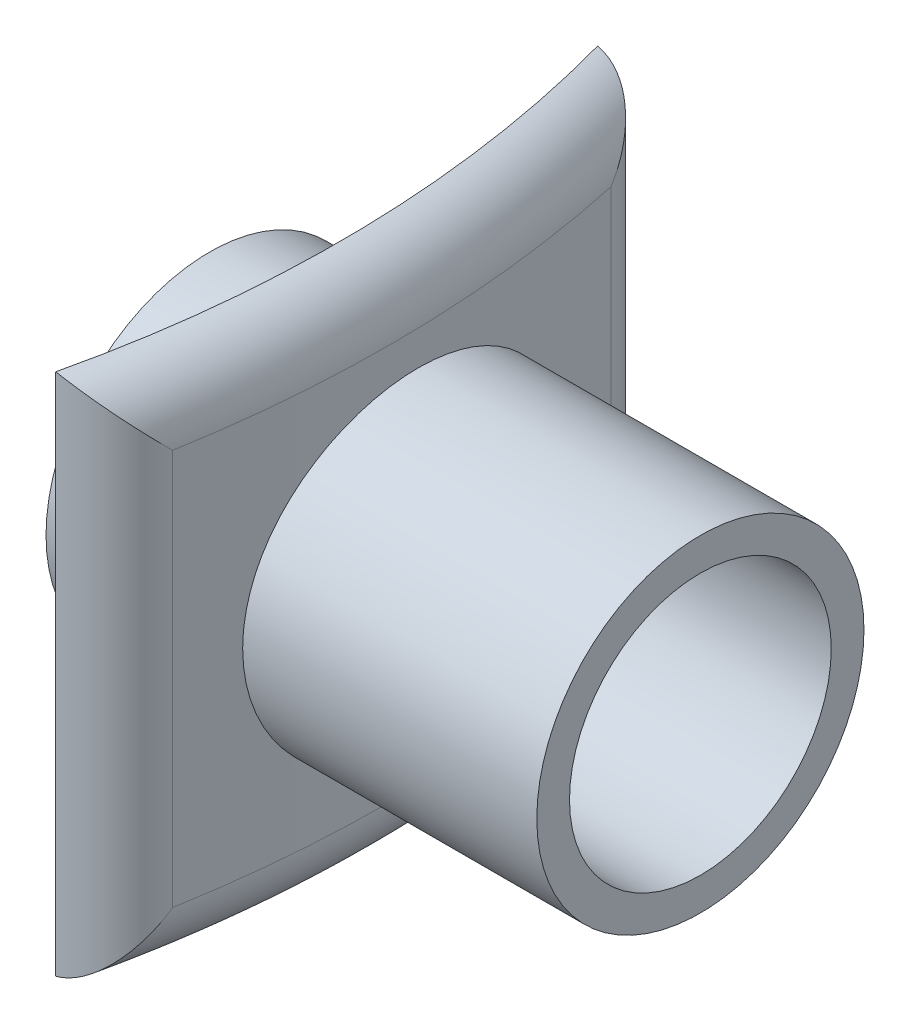
ISO-10303-21;
HEADER;
FILE_DESCRIPTION(('STEP AP214'),'2;1');
FILE_NAME('part.step','',(''),(''),'','','');
FILE_SCHEMA(('AUTOMOTIVE_DESIGN { 1 0 10303 214 1 1 1 1 }'));
ENDSEC;
DATA;
#1=APPLICATION_CONTEXT('core data for automotive mechanical design processes');
#2=APPLICATION_PROTOCOL_DEFINITION('international standard','automotive_design',2000,#1);
#3=PRODUCT_CONTEXT('',#1,'mechanical');
#4=PRODUCT('Part','Part','',(#3));
#5=PRODUCT_RELATED_PRODUCT_CATEGORY('part','',(#4));
#6=PRODUCT_DEFINITION_FORMATION('','',#4);
#7=PRODUCT_DEFINITION_CONTEXT('part definition',#1,'design');
#8=PRODUCT_DEFINITION('design','',#6,#7);
#9=PRODUCT_DEFINITION_SHAPE('','',#8);
#10=(LENGTH_UNIT() NAMED_UNIT(*) SI_UNIT(.MILLI.,.METRE.));
#11=(NAMED_UNIT(*) PLANE_ANGLE_UNIT() SI_UNIT($,.RADIAN.));
#12=(NAMED_UNIT(*) SI_UNIT($,.STERADIAN.) SOLID_ANGLE_UNIT());
#13=UNCERTAINTY_MEASURE_WITH_UNIT(LENGTH_MEASURE(1.E-05),#10,'distance_accuracy_value','');
#14=(GEOMETRIC_REPRESENTATION_CONTEXT(3) GLOBAL_UNCERTAINTY_ASSIGNED_CONTEXT((#13)) GLOBAL_UNIT_ASSIGNED_CONTEXT((#10,
#11,#12)) REPRESENTATION_CONTEXT('',''));
#15=CARTESIAN_POINT('',(0.,0.,0.));
#16=DIRECTION('',(0.,0.,1.));
#17=DIRECTION('',(1.,0.,0.));
#18=AXIS2_PLACEMENT_3D('',#15,#16,#17);
#19=CARTESIAN_POINT('',(15.,0.,0.));
#20=DIRECTION('',(-1.,0.,0.));
#21=DIRECTION('',(0.,0.,1.));
#22=AXIS2_PLACEMENT_3D('',#19,#20,#21);
#23=CYLINDRICAL_SURFACE('',#22,5.);
#24=CARTESIAN_POINT('',(0.,0.,0.));
#25=DIRECTION('',(1.,0.,0.));
#26=DIRECTION('',(0.,0.,-1.));
#27=AXIS2_PLACEMENT_3D('',#24,#25,#26);
#28=CIRCLE('',#27,5.);
#29=CARTESIAN_POINT('',(0.,0.,-5.));
#30=VERTEX_POINT('',#29);
#31=EDGE_CURVE('E183',#30,#30,#28,.T.);
#32=ORIENTED_EDGE('',*,*,#31,.T.);
#33=EDGE_LOOP('',(#32));
#34=FACE_BOUND('',#33,.T.);
#35=CARTESIAN_POINT('',(4.44917981588211,0.,5.));
#36=CARTESIAN_POINT('',(4.44917911633558,-0.139930415510568,5.00000183315159));
#37=CARTESIAN_POINT('',(4.44991744553362,-0.279834688357766,4.99412392857343));
#38=CARTESIAN_POINT('',(4.4528453338377,-0.558686198544076,4.97065819245709));
#39=CARTESIAN_POINT('',(4.45503520201412,-0.697633225692972,4.95306786703639));
#40=CARTESIAN_POINT('',(4.46079788566911,-0.97362663452722,4.9062876135954));
#41=CARTESIAN_POINT('',(4.46437165882238,-1.11067163181438,4.87708965261332));
#42=CARTESIAN_POINT('',(4.47278684955471,-1.38184289617769,4.807298367787));
#43=CARTESIAN_POINT('',(4.47762873096625,-1.51596807579732,4.76670087397435));
#44=CARTESIAN_POINT('',(4.48841615699536,-1.78016154769072,4.67446057603759));
#45=CARTESIAN_POINT('',(4.49436054947994,-1.91023391095801,4.6228292938155));
#46=CARTESIAN_POINT('',(4.50716549187253,-2.16560484992836,4.50884844896092));
#47=CARTESIAN_POINT('',(4.51402637910816,-2.29090164599283,4.44649493743542));
#48=CARTESIAN_POINT('',(4.52843562183407,-2.53573429882887,4.31156337828046));
#49=CARTESIAN_POINT('',(4.53598361109473,-2.65527317325059,4.23899076634416));
#50=CARTESIAN_POINT('',(4.55152717420397,-2.88787793492895,4.08407812647896));
#51=CARTESIAN_POINT('',(4.55952291317301,-3.0009414026879,4.0017344825095));
#52=CARTESIAN_POINT('',(4.57573536181448,-3.22028039164001,3.82746725288139));
#53=CARTESIAN_POINT('',(4.58395293138815,-3.32652162138601,3.73550058330151));
#54=CARTESIAN_POINT('',(4.60030154019633,-3.53093126996503,3.54291544257002));
#55=CARTESIAN_POINT('',(4.6084325462786,-3.62909668634345,3.44229378182047));
#56=CARTESIAN_POINT('',(4.62432678308339,-3.81659215722782,3.23316258062775));
#57=CARTESIAN_POINT('',(4.63209013315163,-3.90592508925385,3.12465562924093));
#58=CARTESIAN_POINT('',(4.64698612735287,-4.07519226578946,2.90043903954912));
#59=CARTESIAN_POINT('',(4.65411853820104,-4.15512303749593,2.78472676385345));
#60=CARTESIAN_POINT('',(4.66750597328013,-4.30510064316727,2.54674726520652));
#61=CARTESIAN_POINT('',(4.67375953028826,-4.37513094970686,2.42446954081811));
#62=CARTESIAN_POINT('',(4.68514372231802,-4.5046669286236,2.17435527050934));
#63=CARTESIAN_POINT('',(4.69027393983362,-4.56416868633564,2.04651667889665));
#64=CARTESIAN_POINT('',(4.69920073538179,-4.67215695098304,1.78627456693971));
#65=CARTESIAN_POINT('',(4.70299786551862,-4.72064801510153,1.6538729613974));
#66=CARTESIAN_POINT('',(4.70909574353309,-4.80630201790285,1.38540706760072));
#67=CARTESIAN_POINT('',(4.71139594305867,-4.84346080272654,1.24934145614209));
#68=CARTESIAN_POINT('',(4.7158148377851,-4.93697463835945,0.839230891125736));
#69=CARTESIAN_POINT('',(4.71553169856963,-4.97628481223209,0.561051827406825));
#70=CARTESIAN_POINT('',(4.70802309570491,-5.00783489635695,0.00228966373802704));
#71=CARTESIAN_POINT('',(4.70079790273673,-5.00007664181493,-0.278293342055803));
#72=CARTESIAN_POINT('',(4.67977240734622,-4.93803402406823,-0.832543729585755));
#73=CARTESIAN_POINT('',(4.66600685447807,-4.88399435460335,-1.10623970332543));
#74=CARTESIAN_POINT('',(4.63294304252601,-4.73136575069864,-1.64054933984618));
#75=CARTESIAN_POINT('',(4.61364455488304,-4.63277497580784,-1.90116246166725));
#76=CARTESIAN_POINT('',(4.57102742088618,-4.39315919750031,-2.40377834716845));
#77=CARTESIAN_POINT('',(4.54768399326359,-4.2518683693458,-2.64565224400981));
#78=CARTESIAN_POINT('',(4.49919557054305,-3.93105919067418,-3.10236450521138));
#79=CARTESIAN_POINT('',(4.47405044902454,-3.75153815588848,-3.31720096949846));
#80=CARTESIAN_POINT('',(4.42409034389036,-3.35720460603166,-3.71599062218461));
#81=CARTESIAN_POINT('',(4.39928116987006,-3.1420573679109,-3.89961376010415));
#82=CARTESIAN_POINT('',(4.35272199807604,-2.68369626674176,-4.2281531280637));
#83=CARTESIAN_POINT('',(4.3309719817655,-2.44048257377705,-4.37306959264985));
#84=CARTESIAN_POINT('',(4.29278873418824,-1.93313526192755,-4.61978686252235));
#85=CARTESIAN_POINT('',(4.27634767764754,-1.6690331540508,-4.721651194664));
#86=CARTESIAN_POINT('',(4.25046885452017,-1.12712673019686,-4.87946800596283));
#87=CARTESIAN_POINT('',(4.24103046715717,-0.849323631121443,-4.93542455482408));
#88=CARTESIAN_POINT('',(4.23023481854564,-0.291583924588795,-4.99927936750501));
#89=CARTESIAN_POINT('',(4.22877902506926,-0.011716232039898,-5.00776362691793));
#90=CARTESIAN_POINT('',(4.23383679160023,0.545438651246245,-4.97798323446594));
#91=CARTESIAN_POINT('',(4.24035004954003,0.8227259393925,-4.93972035455511));
#92=CARTESIAN_POINT('',(4.26059923519645,1.36518438558849,-4.81799715376401));
#93=CARTESIAN_POINT('',(4.27429246553083,1.63041720294997,-4.73480393483821));
#94=CARTESIAN_POINT('',(4.30747490786287,2.14316587301268,-4.52586940839398));
#95=CARTESIAN_POINT('',(4.32696444051267,2.39068074461495,-4.40012574692696));
#96=CARTESIAN_POINT('',(4.36999129851761,2.86343523310111,-4.10835658486742));
#97=CARTESIAN_POINT('',(4.39356368507482,3.08845280638603,-3.94197657603352));
#98=CARTESIAN_POINT('',(4.44231009817555,3.50756289767638,-3.57417781521791));
#99=CARTESIAN_POINT('',(4.46748424025313,3.70165318136102,-3.37275653390043));
#100=CARTESIAN_POINT('',(4.51729942244146,4.0555988399652,-2.93795266100454));
#101=CARTESIAN_POINT('',(4.54193146946011,4.21505121327871,-2.7042407721632));
#102=CARTESIAN_POINT('',(4.58803354045317,4.49243058604295,-2.21305123819728));
#103=CARTESIAN_POINT('',(4.6095036059373,4.61035813064969,-1.95557390513181));
#104=CARTESIAN_POINT('',(4.6473002280526,4.80103143558677,-1.42462528233219));
#105=CARTESIAN_POINT('',(4.66363646723885,4.87386250419699,-1.15118526834765));
#106=CARTESIAN_POINT('',(4.68986929429158,4.97241192052108,-0.595491568337679));
#107=CARTESIAN_POINT('',(4.69976632970861,4.99813354275642,-0.313238496284557));
#108=CARTESIAN_POINT('',(4.70930294692724,5.00078012929847,0.108691850427026));
#109=CARTESIAN_POINT('',(4.71159848983338,4.99578242610426,0.248421531979695));
#110=CARTESIAN_POINT('',(4.71447920283046,4.97411019842571,0.526975838787741));
#111=CARTESIAN_POINT('',(4.71506501860902,4.95744008503948,0.665800785952828));
#112=CARTESIAN_POINT('',(4.71457008111036,4.91252728048902,0.941602154694422));
#113=CARTESIAN_POINT('',(4.71348874551712,4.88428054828077,1.07857791351216));
#114=CARTESIAN_POINT('',(4.70975321944224,4.81643472553042,1.34961548522143));
#115=CARTESIAN_POINT('',(4.70709960494227,4.77683979497782,1.48367834657584));
#116=CARTESIAN_POINT('',(4.70036604324195,4.68672647964083,1.74756190412126));
#117=CARTESIAN_POINT('',(4.69629069882391,4.63624354321477,1.87739482902837));
#118=CARTESIAN_POINT('',(4.68688595208276,4.52466480320587,2.13231317420419));
#119=CARTESIAN_POINT('',(4.68155700647344,4.46357286682611,2.25740030423965));
#120=CARTESIAN_POINT('',(4.66984625255065,4.33117508819449,2.50205432948143));
#121=CARTESIAN_POINT('',(4.66346405726957,4.25986549321255,2.62161917503985));
#122=CARTESIAN_POINT('',(4.64988119583538,4.10758024184029,2.85431470633661));
#123=CARTESIAN_POINT('',(4.64268082199482,4.02660803711734,2.96744766847064));
#124=CARTESIAN_POINT('',(4.62765402298733,3.85490835492335,3.18736349162697));
#125=CARTESIAN_POINT('',(4.61982336007528,3.76411313469779,3.29409317820486));
#126=CARTESIAN_POINT('',(4.60385382916232,3.57393612117979,3.49950918877765));
#127=CARTESIAN_POINT('',(4.59571507315681,3.47455743155746,3.59819839522931));
#128=CARTESIAN_POINT('',(4.57939472737126,3.26781382517958,3.78695088174264));
#129=CARTESIAN_POINT('',(4.5712131148328,3.16044415529153,3.87700895386312));
#130=CARTESIAN_POINT('',(4.55508596821196,2.93855647686793,4.04777440540759));
#131=CARTESIAN_POINT('',(4.54714034880505,2.8240410995033,4.12848519575874));
#132=CARTESIAN_POINT('',(4.53169283523524,2.58785274180135,4.28052222899418));
#133=CARTESIAN_POINT('',(4.52419416183783,2.46613806652157,4.35178404609569));
#134=CARTESIAN_POINT('',(4.5099479397416,2.2171369653933,4.4837654544908));
#135=CARTESIAN_POINT('',(4.50320011796085,2.08985258884513,4.54448888308351));
#136=CARTESIAN_POINT('',(4.49067983685703,1.83065973750014,4.65494496439785));
#137=CARTESIAN_POINT('',(4.48490667281656,1.69875468768835,4.70468556623325));
#138=CARTESIAN_POINT('',(4.47452101314064,1.43121833290496,4.79285458307797));
#139=CARTESIAN_POINT('',(4.46990825997306,1.29558786214731,4.83128550838659));
#140=CARTESIAN_POINT('',(4.46048137240242,0.969055999731658,4.90905731962643));
#141=CARTESIAN_POINT('',(4.45626504297554,0.776856464297776,4.94312393471528));
#142=CARTESIAN_POINT('',(4.45061476383921,0.389754373122137,4.98859390028362));
#143=CARTESIAN_POINT('',(4.44918078999434,0.194851840842181,4.99999744735295));
#144=CARTESIAN_POINT('',(4.44917981588211,0.,5.));
#145=B_SPLINE_CURVE_WITH_KNOTS('',3,(#35,#36,#37,#38,#39,#40,#41,#42,#43,#44,#45,#46,#47,#48,
#49,#50,#51,#52,#53,#54,#55,#56,#57,#58,#59,#60,#61,#62,#63,#64,#65,#66,#67,#68,#69,#70,#71,#72,
#73,#74,#75,#76,#77,#78,#79,#80,#81,#82,#83,#84,#85,#86,#87,#88,#89,#90,#91,#92,#93,#94,#95,#96,
#97,#98,#99,#100,#101,#102,#103,#104,#105,#106,#107,#108,#109,#110,#111,#112,#113,#114,#115,
#116,#117,#118,#119,#120,#121,#122,#123,#124,#125,#126,#127,#128,#129,#130,#131,#132,#133,#134,
#135,#136,#137,#138,#139,#140,#141,#142,#143,#144),.UNSPECIFIED.,.T.,.F.,(4,2,2,2,2,2,2,2,2,2,2,
2,2,2,2,2,2,2,2,2,2,2,2,2,2,2,2,2,2,2,2,2,2,2,2,2,2,2,2,2,2,2,2,2,2,2,2,2,2,2,2,2,2,2,4),(0.,
0.419620956627767,0.83933129018111,1.25933258760136,1.67948772280675,2.09920624137173,
2.51907967056318,2.93873060054314,3.35853732117067,3.78031127826738,4.20224134192547,
4.62403348960578,5.04598094540571,5.46862466924747,5.89142520936736,6.31405043756367,
6.73683039380999,7.57527118749716,8.41367929045014,9.24768183235055,10.0817188308851,
10.9210589072891,11.7604579359636,12.608244609612,13.4560261459141,14.3025523080662,
15.1490034179485,15.9849825328957,16.8209299609701,17.6519616869661,18.4830393942905,
19.321643959908,20.1603090824945,21.0082633729821,21.8562065307417,22.7025407079609,
23.5488160552674,23.967919723242,24.3868650939766,24.8059568304693,25.2248951335995,
25.6424895412999,26.0599320453853,26.4775282621556,26.8949757496917,27.3155117522035,
27.7358963259436,28.1565329793395,28.5770156508409,29.0002321122932,29.4232941449003,
29.8460489639904,30.2687098773939,30.8530333414777,31.4373517368497),.UNSPECIFIED.);
#146=CARTESIAN_POINT('',(4.44917981588211,0.,5.));
#147=VERTEX_POINT('',#146);
#148=EDGE_CURVE('E133',#147,#147,#145,.T.);
#149=ORIENTED_EDGE('',*,*,#148,.F.);
#150=EDGE_LOOP('',(#149));
#151=FACE_BOUND('',#150,.T.);
#152=ADVANCED_FACE('F47',(#34,#151),#23,.T.);
#153=CARTESIAN_POINT('',(15.,0.,0.));
#154=DIRECTION('',(-1.,0.,0.));
#155=DIRECTION('',(0.,0.,1.));
#156=AXIS2_PLACEMENT_3D('',#153,#154,#155);
#157=CYLINDRICAL_SURFACE('',#156,3.3);
#158=CARTESIAN_POINT('',(1.,0.,0.));
#159=DIRECTION('',(-1.,0.,0.));
#160=DIRECTION('',(0.,0.,1.));
#161=AXIS2_PLACEMENT_3D('',#158,#159,#160);
#162=CIRCLE('',#161,3.3);
#163=CARTESIAN_POINT('',(1.,0.,3.3));
#164=VERTEX_POINT('',#163);
#165=EDGE_CURVE('E115',#164,#164,#162,.T.);
#166=ORIENTED_EDGE('',*,*,#165,.F.);
#167=EDGE_LOOP('',(#166));
#168=FACE_BOUND('',#167,.T.);
#169=CARTESIAN_POINT('',(0.,0.,0.));
#170=DIRECTION('',(1.,0.,0.));
#171=DIRECTION('',(0.,0.,-1.));
#172=AXIS2_PLACEMENT_3D('',#169,#170,#171);
#173=CIRCLE('',#172,3.3);
#174=CARTESIAN_POINT('',(0.,0.,-3.3));
#175=VERTEX_POINT('',#174);
#176=EDGE_CURVE('E132',#175,#175,#173,.T.);
#177=ORIENTED_EDGE('',*,*,#176,.F.);
#178=EDGE_LOOP('',(#177));
#179=FACE_BOUND('',#178,.T.);
#180=ADVANCED_FACE('F153',(#168,#179),#157,.F.);
#181=CARTESIAN_POINT('',(0.,0.,0.));
#182=DIRECTION('',(1.,0.,0.));
#183=DIRECTION('',(0.,0.,-1.));
#184=AXIS2_PLACEMENT_3D('',#181,#182,#183);
#185=PLANE('',#184);
#186=ORIENTED_EDGE('',*,*,#31,.F.);
#187=EDGE_LOOP('',(#186));
#188=FACE_BOUND('',#187,.T.);
#189=ORIENTED_EDGE('',*,*,#176,.T.);
#190=EDGE_LOOP('',(#189));
#191=FACE_BOUND('',#190,.T.);
#192=ADVANCED_FACE('F152',(#188,#191),#185,.F.);
#193=CARTESIAN_POINT('',(-29.5351271222658,-8.,0.742138807599469));
#194=DIRECTION('',(0.,1.,0.));
#195=DIRECTION('',(0.,0.,1.));
#196=AXIS2_PLACEMENT_3D('',#193,#194,#195);
#197=CYLINDRICAL_SURFACE('',#196,34.25);
#198=DIRECTION('',(0.,1.,0.));
#199=VECTOR('',#198,1.);
#200=CARTESIAN_POINT('',(3.81946698227984,-8.,8.52246991372905));
#201=LINE('',#200,#199);
#202=CARTESIAN_POINT('',(3.81946698227984,-8.,8.52246991372905));
#203=VERTEX_POINT('',#202);
#204=CARTESIAN_POINT('',(3.81946698227984,8.,8.52246991372905));
#205=VERTEX_POINT('',#204);
#206=EDGE_CURVE('E108',#203,#205,#201,.T.);
#207=ORIENTED_EDGE('',*,*,#206,.T.);
#208=CARTESIAN_POINT('',(-29.5351271222658,8.,0.742138807599469));
#209=DIRECTION('',(0.,1.,0.));
#210=DIRECTION('',(0.,0.,1.));
#211=AXIS2_PLACEMENT_3D('',#208,#209,#210);
#212=CIRCLE('',#211,34.25);
#213=CARTESIAN_POINT('',(3.47750715547917,8.,-8.38082551568144));
#214=VERTEX_POINT('',#213);
#215=EDGE_CURVE('E97',#205,#214,#212,.T.);
#216=ORIENTED_EDGE('',*,*,#215,.T.);
#217=DIRECTION('',(0.,1.,0.));
#218=VECTOR('',#217,1.);
#219=CARTESIAN_POINT('',(3.47750715547917,-8.,-8.38082551568144));
#220=LINE('',#219,#218);
#221=CARTESIAN_POINT('',(3.47750715547917,-8.,-8.38082551568144));
#222=VERTEX_POINT('',#221);
#223=EDGE_CURVE('E102',#222,#214,#220,.T.);
#224=ORIENTED_EDGE('',*,*,#223,.F.);
#225=CARTESIAN_POINT('',(-29.5351271222658,-8.,0.742138807599469));
#226=DIRECTION('',(0.,1.,0.));
#227=DIRECTION('',(0.,0.,1.));
#228=AXIS2_PLACEMENT_3D('',#225,#226,#227);
#229=CIRCLE('',#228,34.25);
#230=EDGE_CURVE('E114',#203,#222,#229,.T.);
#231=ORIENTED_EDGE('',*,*,#230,.F.);
#232=EDGE_LOOP('',(#207,#216,#224,#231));
#233=FACE_BOUND('',#232,.T.);
#234=ORIENTED_EDGE('',*,*,#148,.T.);
#235=EDGE_LOOP('',(#234));
#236=FACE_BOUND('',#235,.T.);
#237=ADVANCED_FACE('F110',(#233,#236),#197,.F.);
#238=CARTESIAN_POINT('',(-29.5351271222658,-8.,0.742138807599469));
#239=DIRECTION('',(0.,1.,0.));
#240=DIRECTION('',(0.,0.,1.));
#241=AXIS2_PLACEMENT_3D('',#238,#239,#240);
#242=CYLINDRICAL_SURFACE('',#241,35.8);
#243=DIRECTION('',(0.,1.,0.));
#244=VECTOR('',#243,1.);
#245=CARTESIAN_POINT('',(5.46084710193839,-8.,-6.80251413994131));
#246=LINE('',#245,#244);
#247=CARTESIAN_POINT('',(5.46084710193838,-6.05128247300949,-6.80251413994131));
#248=VERTEX_POINT('',#247);
#249=CARTESIAN_POINT('',(5.46084710193838,6.05128247300949,-6.80251413994131));
#250=VERTEX_POINT('',#249);
#251=EDGE_CURVE('E61',#248,#250,#246,.T.);
#252=ORIENTED_EDGE('',*,*,#251,.T.);
#253=CARTESIAN_POINT('',(-29.5351271222658,6.05128247300949,0.742138807599469));
#254=DIRECTION('',(0.,1.,0.));
#255=DIRECTION('',(0.,0.,1.));
#256=AXIS2_PLACEMENT_3D('',#253,#254,#255);
#257=CIRCLE('',#256,35.8);
#258=CARTESIAN_POINT('',(5.73735065546689,6.05128247300949,6.86523536239528));
#259=VERTEX_POINT('',#258);
#260=EDGE_CURVE('E12',#250,#259,#257,.F.);
#261=ORIENTED_EDGE('',*,*,#260,.T.);
#262=DIRECTION('',(0.,1.,0.));
#263=VECTOR('',#262,1.);
#264=CARTESIAN_POINT('',(5.7373506554669,-8.,6.86523536239528));
#265=LINE('',#264,#263);
#266=CARTESIAN_POINT('',(5.73735065546689,-6.05128247300949,6.86523536239528));
#267=VERTEX_POINT('',#266);
#268=EDGE_CURVE('E186',#259,#267,#265,.F.);
#269=ORIENTED_EDGE('',*,*,#268,.T.);
#270=CARTESIAN_POINT('',(-29.5351271222658,-6.05128247300949,0.742138807599469));
#271=DIRECTION('',(0.,-1.,0.));
#272=DIRECTION('',(0.,0.,-1.));
#273=AXIS2_PLACEMENT_3D('',#270,#271,#272);
#274=CIRCLE('',#273,35.8);
#275=EDGE_CURVE('E72',#267,#248,#274,.F.);
#276=ORIENTED_EDGE('',*,*,#275,.T.);
#277=EDGE_LOOP('',(#252,#261,#269,#276));
#278=FACE_BOUND('',#277,.T.);
#279=CARTESIAN_POINT('',(6.01076740953983,0.,5.));
#280=CARTESIAN_POINT('',(6.01076676811268,-0.139976779439951,5.00000175572198));
#281=CARTESIAN_POINT('',(6.01147311065638,-0.279928233254733,4.99411998938864));
#282=CARTESIAN_POINT('',(6.01427426078213,-0.558874581096245,4.97063840387493));
#283=CARTESIAN_POINT('',(6.01636936998484,-0.697869260697695,4.95303603914112));
#284=CARTESIAN_POINT('',(6.02188283854055,-0.973960794698163,4.90622277073541));
#285=CARTESIAN_POINT('',(6.02530213639934,-1.11105623148785,4.87700363339752));
#286=CARTESIAN_POINT('',(6.03335378792889,-1.38232819307238,4.80716045615124));
#287=CARTESIAN_POINT('',(6.0379865853971,-1.51650363048971,4.76653224335741));
#288=CARTESIAN_POINT('',(6.04830852150418,-1.78079859550257,4.67421974204676));
#289=CARTESIAN_POINT('',(6.053996574966,-1.91092213078147,4.62254680319165));
#290=CARTESIAN_POINT('',(6.06624959102172,-2.1663925511885,4.50847203299793));
#291=CARTESIAN_POINT('',(6.07281487646179,-2.29173765578497,4.44606624922921));
#292=CARTESIAN_POINT('',(6.08660341583165,-2.5366611002151,4.31102033584825));
#293=CARTESIAN_POINT('',(6.09382631440265,-2.65624250181174,4.23838572218987));
#294=CARTESIAN_POINT('',(6.10870040999171,-2.88892525594943,4.08333973236982));
#295=CARTESIAN_POINT('',(6.11635176493909,-3.00202418754825,4.00092473845729));
#296=CARTESIAN_POINT('',(6.1318623987411,-3.22137884896372,3.82654324294244));
#297=CARTESIAN_POINT('',(6.13972242526818,-3.32760333211786,3.73453749978052));
#298=CARTESIAN_POINT('',(6.15535924573954,-3.53197516727451,3.54187527118223));
#299=CARTESIAN_POINT('',(6.16313600780746,-3.63011951580497,3.44121559715494));
#300=CARTESIAN_POINT('',(6.17833713278799,-3.8175677945896,3.23201103835038));
#301=CARTESIAN_POINT('',(6.18576161017854,-3.90687460706099,3.12346874451723));
#302=CARTESIAN_POINT('',(6.20000653714346,-4.07608435907643,2.89918566594222));
#303=CARTESIAN_POINT('',(6.20682676325251,-4.15598382314116,2.78344224478031));
#304=CARTESIAN_POINT('',(6.2196260108033,-4.30588072411856,2.54542709334913));
#305=CARTESIAN_POINT('',(6.22560377807317,-4.37586339869681,2.42314599600545));
#306=CARTESIAN_POINT('',(6.23648478347788,-4.5053040351264,2.17303339754295));
#307=CARTESIAN_POINT('',(6.24138762227118,-4.56475808396617,2.04519985472078));
#308=CARTESIAN_POINT('',(6.24991739066022,-4.67265259165797,1.78497560110754));
#309=CARTESIAN_POINT('',(6.25354484370014,-4.72109756596354,1.65258678444327));
#310=CARTESIAN_POINT('',(6.25936834155113,-4.80666227760358,1.3841536373422));
#311=CARTESIAN_POINT('',(6.26156386143375,-4.84377785907769,1.24810798536404));
#312=CARTESIAN_POINT('',(6.26577857582776,-4.93720762175466,0.837896510850369));
#313=CARTESIAN_POINT('',(6.26549668006718,-4.97645475644563,0.559598221211234));
#314=CARTESIAN_POINT('',(6.25828570721191,-5.00784169026665,0.000602150020324117));
#315=CARTESIAN_POINT('',(6.25135686904498,-4.99998318257997,-0.280095544924155));
#316=CARTESIAN_POINT('',(6.23120038419758,-4.93768447425978,-0.834697605834267));
#317=CARTESIAN_POINT('',(6.21800319268399,-4.88346849573187,-1.10862815191372));
#318=CARTESIAN_POINT('',(6.1863104117308,-4.73039801200129,-1.64338397988708));
#319=CARTESIAN_POINT('',(6.16781461948211,-4.63154179806682,-1.90420875969582));
#320=CARTESIAN_POINT('',(6.12698935492686,-4.39136693966485,-2.4070695310999));
#321=CARTESIAN_POINT('',(6.10463811756631,-4.24980360425412,-2.64898685729335));
#322=CARTESIAN_POINT('',(6.05822461161474,-3.92841317581714,-3.10573036423376));
#323=CARTESIAN_POINT('',(6.03416223323149,-3.748583626032,-3.32055480415829));
#324=CARTESIAN_POINT('',(5.98639204067848,-3.35378631346025,-3.71907214770943));
#325=CARTESIAN_POINT('',(5.96268947564281,-3.1385124802344,-3.90246263972674));
#326=CARTESIAN_POINT('',(5.91822523564347,-2.67996269624744,-4.2305163114771));
#327=CARTESIAN_POINT('',(5.89746354309602,-2.43668691292859,-4.37517972276786));
#328=CARTESIAN_POINT('',(5.86103133465076,-1.92927416009518,-4.62139651953696));
#329=CARTESIAN_POINT('',(5.84535372651682,-1.66516689566902,-4.72301002032627));
#330=CARTESIAN_POINT('',(5.82069476884527,-1.12332347742152,-4.8803394704295));
#331=CARTESIAN_POINT('',(5.81171287907586,-0.845588425060926,-4.93605912264276));
#332=CARTESIAN_POINT('',(5.80146131761628,-0.287742048419146,-4.99951192984453));
#333=CARTESIAN_POINT('',(5.80010549362941,-0.00769321426723289,-5.00778115783658));
#334=CARTESIAN_POINT('',(5.80501704965152,0.549787534339203,-4.97751471902551));
#335=CARTESIAN_POINT('',(5.81128416538344,0.827219539179643,-4.93898067482882));
#336=CARTESIAN_POINT('',(5.83073055881814,1.37007969882954,-4.81662684979426));
#337=CARTESIAN_POINT('',(5.84387274389158,1.63556404691041,-4.73305001308336));
#338=CARTESIAN_POINT('',(5.87570357355029,2.14874729817989,-4.52324447469511));
#339=CARTESIAN_POINT('',(5.89439250100449,2.39644529351204,-4.39701359773089));
#340=CARTESIAN_POINT('',(5.93562342014618,2.86928950624338,-4.10428291113357));
#341=CARTESIAN_POINT('',(5.95819612850874,3.09423130141886,-3.93745730979799));
#342=CARTESIAN_POINT('',(6.00485970537873,3.5130993474901,-3.56875223278158));
#343=CARTESIAN_POINT('',(6.02895067403833,3.70702354931587,-3.36687044307087));
#344=CARTESIAN_POINT('',(6.07658050386746,4.06035613227914,-2.93136905556142));
#345=CARTESIAN_POINT('',(6.10011132520196,4.21939589834878,-2.6974493393325));
#346=CARTESIAN_POINT('',(6.14413294963136,4.49592187569529,-2.20594092639749));
#347=CARTESIAN_POINT('',(6.16462379070124,4.613408606072,-1.94835252542225));
#348=CARTESIAN_POINT('',(6.20067719272571,4.80320660012409,-1.41726155651443));
#349=CARTESIAN_POINT('',(6.21624849185497,4.8755981874317,-1.14378823858334));
#350=CARTESIAN_POINT('',(6.2412267309655,4.97328288702779,-0.588130234665964));
#351=CARTESIAN_POINT('',(6.25063406144173,4.99857898306037,-0.305946101706653));
#352=CARTESIAN_POINT('',(6.25967202709669,5.00061912875577,0.115945290448778));
#353=CARTESIAN_POINT('',(6.26184059792563,4.99541521342822,0.255735891227796));
#354=CARTESIAN_POINT('',(6.26454024859648,4.9733208033584,0.534392107723251));
#355=CARTESIAN_POINT('',(6.26507194533599,4.9564347142794,0.673258052226483));
#356=CARTESIAN_POINT('',(6.26454062322742,4.91108179112902,0.949122305685106));
#357=CARTESIAN_POINT('',(6.2634770440462,4.88261089050717,1.08611994134831));
#358=CARTESIAN_POINT('',(6.25984574085005,4.8143099820063,1.35718224983084));
#359=CARTESIAN_POINT('',(6.25727856791258,4.77448413853509,1.49124797854967));
#360=CARTESIAN_POINT('',(6.2507801053742,4.68388807408262,1.75516469382064));
#361=CARTESIAN_POINT('',(6.24685273569933,4.63314945996061,1.88502663181421));
#362=CARTESIAN_POINT('',(6.23779987398847,4.52104738059314,2.13998022620693));
#363=CARTESIAN_POINT('',(6.23267481876282,4.45968779105597,2.2650736024577));
#364=CARTESIAN_POINT('',(6.22142018327958,4.32674438688846,2.50971535467142));
#365=CARTESIAN_POINT('',(6.21529023668168,4.25515684481246,2.62926168795175));
#366=CARTESIAN_POINT('',(6.20225119662167,4.10230766319657,2.86189365493047));
#367=CARTESIAN_POINT('',(6.19534238227736,4.02104948868116,2.97498158133616));
#368=CARTESIAN_POINT('',(6.18093471071686,3.84881915244196,3.19471601836577));
#369=CARTESIAN_POINT('',(6.17343214573884,3.75778443378994,3.30131325776428));
#370=CARTESIAN_POINT('',(6.15813836189474,3.56713592846876,3.5064427373452));
#371=CARTESIAN_POINT('',(6.15034724816841,3.4675252494707,3.6049778739582));
#372=CARTESIAN_POINT('',(6.13473059977862,3.26032765464761,3.79340000956611));
#373=CARTESIAN_POINT('',(6.12690504724647,3.1527359823779,3.88328177688341));
#374=CARTESIAN_POINT('',(6.11148651587485,2.93041784809695,4.05367226589961));
#375=CARTESIAN_POINT('',(6.10389345287814,2.81569401448793,4.13418440952067));
#376=CARTESIAN_POINT('',(6.08914232734355,2.57916567686336,4.28576152879448));
#377=CARTESIAN_POINT('',(6.08198713816897,2.45732292725955,4.35676712075149));
#378=CARTESIAN_POINT('',(6.06840071887844,2.20809126899863,4.48822639983691));
#379=CARTESIAN_POINT('',(6.06196922546364,2.08070440097743,4.54868392905403));
#380=CARTESIAN_POINT('',(6.0500437574921,1.82133554232975,4.6586003772093));
#381=CARTESIAN_POINT('',(6.04454909235211,1.68935702360978,4.70806740602326));
#382=CARTESIAN_POINT('',(6.03467325618776,1.4217014350147,4.79568528775753));
#383=CARTESIAN_POINT('',(6.03029183421499,1.28602520633024,4.83383869133115));
#384=CARTESIAN_POINT('',(6.02139280099595,0.960966225787901,4.9105828160615));
#385=CARTESIAN_POINT('',(6.01742835297511,0.770342409416696,4.94407870651469));
#386=CARTESIAN_POINT('',(6.01211610983651,0.386462965460867,4.98878600235305));
#387=CARTESIAN_POINT('',(6.01076829488984,0.193207357831212,4.99999757660945));
#388=CARTESIAN_POINT('',(6.01076740953983,0.,5.));
#389=B_SPLINE_CURVE_WITH_KNOTS('',3,(#279,#280,#281,#282,#283,#284,#285,#286,#287,#288,#289,
#290,#291,#292,#293,#294,#295,#296,#297,#298,#299,#300,#301,#302,#303,#304,#305,#306,#307,#308,
#309,#310,#311,#312,#313,#314,#315,#316,#317,#318,#319,#320,#321,#322,#323,#324,#325,#326,#327,
#328,#329,#330,#331,#332,#333,#334,#335,#336,#337,#338,#339,#340,#341,#342,#343,#344,#345,#346,
#347,#348,#349,#350,#351,#352,#353,#354,#355,#356,#357,#358,#359,#360,#361,#362,#363,#364,#365,
#366,#367,#368,#369,#370,#371,#372,#373,#374,#375,#376,#377,#378,#379,#380,#381,#382,#383,#384,
#385,#386,#387,#388),.UNSPECIFIED.,.T.,.F.,(4,2,2,2,2,2,2,2,2,2,2,2,2,2,2,2,2,2,2,2,2,2,2,2,2,2,
2,2,2,2,2,2,2,2,2,2,2,2,2,2,2,2,2,2,2,2,2,2,2,2,2,2,2,2,4),(0.,0.419761500102866,
0.839614196403368,1.25976500539633,1.6800696857388,2.09994451597965,2.5199742998522,
2.93977844152453,3.35973835512176,3.78148956512654,4.20339684331777,4.62516606673222,
5.04709062414044,5.46963681327959,5.89233971554419,6.31486892889406,6.73755294913122,
7.57632351223497,8.41506392642892,9.24977031656661,10.0845086601712,10.924123530715,
11.7637923222965,12.6111338428939,13.4584702969372,14.3046195907361,15.1507006071346,
15.9872038795028,16.8236781522566,17.6556852959668,18.4877348770972,19.3266960412058,
20.16571260551,21.0132081067417,21.8606930202915,22.7066640416089,23.5525814644422,
23.9718842625455,24.391029016377,24.8103210273071,25.2294594609057,25.6473999021572,
26.0651881527274,26.4831290510738,26.9009206479155,27.3215658099241,27.7420591791804,
28.1628051956857,28.5833970641969,29.0065044956903,29.4294574888143,29.8520973412246,
30.2746418370405,30.854035256946,31.4334242861737),.UNSPECIFIED.);
#390=CARTESIAN_POINT('',(6.01076740953983,0.,5.));
#391=VERTEX_POINT('',#390);
#392=EDGE_CURVE('E107',#391,#391,#389,.T.);
#393=ORIENTED_EDGE('',*,*,#392,.F.);
#394=EDGE_LOOP('',(#393));
#395=FACE_BOUND('',#394,.T.);
#396=ADVANCED_FACE('F143',(#278,#395),#242,.T.);
#397=ORIENTED_EDGE('',*,*,#392,.T.);
#398=EDGE_LOOP('',(#397));
#399=FACE_BOUND('',#398,.T.);
#400=CARTESIAN_POINT('',(15.,0.,0.));
#401=DIRECTION('',(1.,0.,0.));
#402=DIRECTION('',(0.,0.,-1.));
#403=AXIS2_PLACEMENT_3D('',#400,#401,#402);
#404=CIRCLE('',#403,5.);
#405=CARTESIAN_POINT('',(15.,0.,-5.));
#406=VERTEX_POINT('',#405);
#407=EDGE_CURVE('E181',#406,#406,#404,.T.);
#408=ORIENTED_EDGE('',*,*,#407,.F.);
#409=EDGE_LOOP('',(#408));
#410=FACE_BOUND('',#409,.T.);
#411=ADVANCED_FACE('F139',(#399,#410),#23,.T.);
#412=CARTESIAN_POINT('',(15.,0.,0.));
#413=DIRECTION('',(1.,0.,0.));
#414=DIRECTION('',(0.,0.,-1.));
#415=AXIS2_PLACEMENT_3D('',#412,#413,#414);
#416=PLANE('',#415);
#417=CARTESIAN_POINT('',(15.,0.,0.));
#418=DIRECTION('',(1.,0.,0.));
#419=DIRECTION('',(0.,0.,-1.));
#420=AXIS2_PLACEMENT_3D('',#417,#418,#419);
#421=CIRCLE('',#420,4.);
#422=CARTESIAN_POINT('',(15.,0.,-4.));
#423=VERTEX_POINT('',#422);
#424=EDGE_CURVE('E119',#423,#423,#421,.F.);
#425=ORIENTED_EDGE('',*,*,#424,.T.);
#426=EDGE_LOOP('',(#425));
#427=FACE_BOUND('',#426,.T.);
#428=ORIENTED_EDGE('',*,*,#407,.T.);
#429=EDGE_LOOP('',(#428));
#430=FACE_BOUND('',#429,.T.);
#431=ADVANCED_FACE('F157',(#427,#430),#416,.T.);
#432=CARTESIAN_POINT('',(1.,0.,0.));
#433=DIRECTION('',(-1.,0.,0.));
#434=DIRECTION('',(0.,0.,1.));
#435=AXIS2_PLACEMENT_3D('',#432,#433,#434);
#436=PLANE('',#435);
#437=ORIENTED_EDGE('',*,*,#165,.T.);
#438=EDGE_LOOP('',(#437));
#439=FACE_BOUND('',#438,.T.);
#440=CARTESIAN_POINT('',(1.,0.,0.));
#441=DIRECTION('',(-1.,0.,0.));
#442=DIRECTION('',(0.,0.,1.));
#443=AXIS2_PLACEMENT_3D('',#440,#441,#442);
#444=CIRCLE('',#443,4.);
#445=CARTESIAN_POINT('',(1.,0.,4.));
#446=VERTEX_POINT('',#445);
#447=EDGE_CURVE('E218',#446,#446,#444,.T.);
#448=ORIENTED_EDGE('',*,*,#447,.F.);
#449=EDGE_LOOP('',(#448));
#450=FACE_BOUND('',#449,.T.);
#451=ADVANCED_FACE('F159',(#439,#450),#436,.F.);
#452=CARTESIAN_POINT('',(26.3137084989848,0.,0.));
#453=DIRECTION('',(-1.,0.,0.));
#454=DIRECTION('',(0.,0.,1.));
#455=AXIS2_PLACEMENT_3D('',#452,#453,#454);
#456=CYLINDRICAL_SURFACE('',#455,4.);
#457=ORIENTED_EDGE('',*,*,#447,.T.);
#458=EDGE_LOOP('',(#457));
#459=FACE_BOUND('',#458,.T.);
#460=ORIENTED_EDGE('',*,*,#424,.F.);
#461=EDGE_LOOP('',(#460));
#462=FACE_BOUND('',#461,.T.);
#463=ADVANCED_FACE('F147',(#459,#462),#456,.F.);
#464=CARTESIAN_POINT('',(-29.5351271222658,-6.05128247300949,0.742138807599469));
#465=DIRECTION('',(0.,-1.,0.));
#466=DIRECTION('',(0.,0.,-1.));
#467=AXIS2_PLACEMENT_3D('',#464,#465,#466);
#468=TOROIDAL_SURFACE('',#467,33.8,2.);
#469=CARTESIAN_POINT('',(3.47750715547917,-8.,-8.38082551568144));
#470=CARTESIAN_POINT('',(3.52961823488851,-7.98836011090352,-8.38156699166574));
#471=CARTESIAN_POINT('',(3.58128700818878,-7.97487243865995,-8.38025433790259));
#472=CARTESIAN_POINT('',(3.68330740869494,-7.94457136109449,-8.37378270267723));
#473=CARTESIAN_POINT('',(3.73366104642785,-7.92776341506891,-8.36862999709181));
#474=CARTESIAN_POINT('',(3.88130966031582,-7.87323176663703,-8.34794296332676));
#475=CARTESIAN_POINT('',(3.97630470140095,-7.83113968956427,-8.32718362206051));
#476=CARTESIAN_POINT('',(4.15753249486558,-7.73833950587938,-8.27419283973812));
#477=CARTESIAN_POINT('',(4.24381646675894,-7.68768709403993,-8.24203416731908));
#478=CARTESIAN_POINT('',(4.40795688405582,-7.5796007093843,-8.16824859497671));
#479=CARTESIAN_POINT('',(4.48578663370455,-7.52214638732408,-8.12659292030569));
#480=CARTESIAN_POINT('',(4.67489440910318,-7.36771596175327,-8.00942118326911));
#481=CARTESIAN_POINT('',(4.77963482390622,-7.26702863386903,-7.92821731276751));
#482=CARTESIAN_POINT('',(4.96761721935176,-7.05792751539662,-7.7520211570454));
#483=CARTESIAN_POINT('',(5.05081547493848,-6.94949857133133,-7.65700142988612));
#484=CARTESIAN_POINT('',(5.20663281274214,-6.71227809340753,-7.44263791257621));
#485=CARTESIAN_POINT('',(5.27605297742087,-6.5827872725292,-7.32175759408028));
#486=CARTESIAN_POINT('',(5.3879210676883,-6.32136770597164,-7.07113572213844));
#487=CARTESIAN_POINT('',(5.43043304588443,-6.18944552493237,-6.94141603238381));
#488=CARTESIAN_POINT('',(5.45991602302705,-6.05555894651157,-6.80681570640584));
#489=CARTESIAN_POINT('',(5.46038334086982,-6.0534206835568,-6.80466527895887));
#490=CARTESIAN_POINT('',(5.46084710193838,-6.05128247300949,-6.8025141399413));
#491=B_SPLINE_CURVE_WITH_KNOTS('',3,(#469,#470,#471,#472,#473,#474,#475,#476,#477,#478,#479,
#480,#481,#482,#483,#484,#485,#486,#487,#488,#489,#490),.UNSPECIFIED.,.F.,.F.,(4,2,2,2,2,2,2,2,
2,2,4),(0.,0.160033383022211,0.319805792141466,0.635978419669323,0.950168039518428,
1.26532257333563,1.7619038926736,2.25948538029074,2.82800038773519,3.39515695393989,
3.40436205288209),.UNSPECIFIED.);
#492=EDGE_CURVE('E104',#248,#222,#491,.F.);
#493=ORIENTED_EDGE('',*,*,#492,.F.);
#494=ORIENTED_EDGE('',*,*,#275,.F.);
#495=CARTESIAN_POINT('',(3.81946698227984,-8.,8.52246991372905));
#496=CARTESIAN_POINT('',(3.8715654127672,-7.98836011090352,8.52110319334981));
#497=CARTESIAN_POINT('',(3.92313882145471,-7.97487243865996,8.51770191261928));
#498=CARTESIAN_POINT('',(4.02481400886893,-7.9445713610945,8.50710944141514));
#499=CARTESIAN_POINT('',(4.07491805030031,-7.92776341506892,8.49992444036927));
#500=CARTESIAN_POINT('',(4.22160918798663,-7.87323176663704,8.47328280616024));
#501=CARTESIAN_POINT('',(4.31568690962859,-7.83113968956428,8.44869845399804));
#502=CARTESIAN_POINT('',(4.49462325388776,-7.7383395058794,8.38842141991071));
#503=CARTESIAN_POINT('',(4.5795359971786,-7.68768709403994,8.35279937555228));
#504=CARTESIAN_POINT('',(4.74055791801293,-7.57960070938431,8.27243565060686));
#505=CARTESIAN_POINT('',(4.81663925787314,-7.52214638732408,8.22766629850348));
#506=CARTESIAN_POINT('',(5.00085339080835,-7.36771596175332,8.10294212320725));
#507=CARTESIAN_POINT('',(5.10222388329704,-7.26702863386919,8.01756855393565));
#508=CARTESIAN_POINT('',(5.28292636306482,-7.0579275153965,7.83391376882415));
#509=CARTESIAN_POINT('',(5.36221355119737,-6.94949857133082,7.73560690192235));
#510=CARTESIAN_POINT('',(5.50923364328303,-6.71227809340814,7.51511687303814));
#511=CARTESIAN_POINT('',(5.57370810343026,-6.58278727253161,7.39152781748348));
#512=CARTESIAN_POINT('',(5.67534846798148,-6.32136770596926,7.13658659169386));
#513=CARTESIAN_POINT('',(5.71257925684403,-6.18944552492342,7.00525367670633));
#514=CARTESIAN_POINT('',(5.73659431167753,-6.05555894651128,6.8695710660363));
#515=CARTESIAN_POINT('',(5.73697427489368,-6.05342068355666,6.86740349778459));
#516=CARTESIAN_POINT('',(5.73735065546689,-6.05128247300949,6.86523536239528));
#517=B_SPLINE_CURVE_WITH_KNOTS('',3,(#495,#496,#497,#498,#499,#500,#501,#502,#503,#504,#505,
#506,#507,#508,#509,#510,#511,#512,#513,#514,#515,#516),.UNSPECIFIED.,.F.,.F.,(4,2,2,2,2,2,2,2,
2,2,4),(0.,0.160033383022204,0.319805792141455,0.635978419669325,0.950168039518439,
1.26532257333563,1.76190389267358,2.25948538029074,2.82800038773521,3.39515695393991,
3.40436205288212),.UNSPECIFIED.);
#518=EDGE_CURVE('E52',#203,#267,#517,.T.);
#519=ORIENTED_EDGE('',*,*,#518,.F.);
#520=ORIENTED_EDGE('',*,*,#230,.T.);
#521=EDGE_LOOP('',(#493,#494,#519,#520));
#522=FACE_BOUND('',#521,.T.);
#523=ADVANCED_FACE('F49',(#522),#468,.T.);
#524=CARTESIAN_POINT('',(3.76682117067735,-8.,6.52316292916646));
#525=DIRECTION('',(0.,-1.,0.));
#526=DIRECTION('',(0.,0.,-1.));
#527=AXIS2_PLACEMENT_3D('',#524,#525,#526);
#528=CYLINDRICAL_SURFACE('',#527,2.);
#529=ORIENTED_EDGE('',*,*,#518,.T.);
#530=ORIENTED_EDGE('',*,*,#268,.F.);
#531=CARTESIAN_POINT('',(3.81946698227984,8.,8.52246991372905));
#532=CARTESIAN_POINT('',(3.8715654127672,7.98836011090352,8.52110319334981));
#533=CARTESIAN_POINT('',(3.92313882145471,7.97487243865996,8.51770191261928));
#534=CARTESIAN_POINT('',(4.02481400886893,7.9445713610945,8.50710944141514));
#535=CARTESIAN_POINT('',(4.07491805030031,7.92776341506892,8.49992444036927));
#536=CARTESIAN_POINT('',(4.22160918798663,7.87323176663704,8.47328280616024));
#537=CARTESIAN_POINT('',(4.31568690962859,7.83113968956428,8.44869845399804));
#538=CARTESIAN_POINT('',(4.49462325388776,7.7383395058794,8.38842141991071));
#539=CARTESIAN_POINT('',(4.5795359971786,7.68768709403994,8.35279937555228));
#540=CARTESIAN_POINT('',(4.74055791801293,7.57960070938431,8.27243565060686));
#541=CARTESIAN_POINT('',(4.81663925787314,7.52214638732408,8.22766629850348));
#542=CARTESIAN_POINT('',(5.00085339080835,7.36771596175332,8.10294212320725));
#543=CARTESIAN_POINT('',(5.10222388329704,7.26702863386919,8.01756855393565));
#544=CARTESIAN_POINT('',(5.28292636306482,7.0579275153965,7.83391376882415));
#545=CARTESIAN_POINT('',(5.36221355119737,6.94949857133082,7.73560690192235));
#546=CARTESIAN_POINT('',(5.50923364328303,6.71227809340814,7.51511687303814));
#547=CARTESIAN_POINT('',(5.57370810343026,6.58278727253161,7.39152781748348));
#548=CARTESIAN_POINT('',(5.67534846798148,6.32136770596926,7.13658659169386));
#549=CARTESIAN_POINT('',(5.71257925684403,6.18944552492342,7.00525367670633));
#550=CARTESIAN_POINT('',(5.73659431167753,6.05555894651128,6.8695710660363));
#551=CARTESIAN_POINT('',(5.73697427489368,6.05342068355666,6.86740349778459));
#552=CARTESIAN_POINT('',(5.73735065546689,6.05128247300949,6.86523536239528));
#553=B_SPLINE_CURVE_WITH_KNOTS('',3,(#531,#532,#533,#534,#535,#536,#537,#538,#539,#540,#541,
#542,#543,#544,#545,#546,#547,#548,#549,#550,#551,#552),.UNSPECIFIED.,.F.,.F.,(4,2,2,2,2,2,2,2,
2,2,4),(0.,0.160033383022204,0.319805792141455,0.635978419669325,0.950168039518439,
1.26532257333563,1.76190389267358,2.25948538029074,2.82800038773521,3.39515695393991,
3.40436205288212),.UNSPECIFIED.);
#554=EDGE_CURVE('E99',#205,#259,#553,.T.);
#555=ORIENTED_EDGE('',*,*,#554,.F.);
#556=ORIENTED_EDGE('',*,*,#206,.F.);
#557=EDGE_LOOP('',(#529,#530,#555,#556));
#558=FACE_BOUND('',#557,.T.);
#559=ADVANCED_FACE('F204',(#558),#528,.T.);
#560=CARTESIAN_POINT('',(3.50576474304429,-8.,-6.38102514845858));
#561=DIRECTION('',(0.,-1.,0.));
#562=DIRECTION('',(0.,0.,-1.));
#563=AXIS2_PLACEMENT_3D('',#560,#561,#562);
#564=CYLINDRICAL_SURFACE('',#563,2.);
#565=ORIENTED_EDGE('',*,*,#492,.T.);
#566=ORIENTED_EDGE('',*,*,#223,.T.);
#567=CARTESIAN_POINT('',(3.47750715547917,8.,-8.38082551568144));
#568=CARTESIAN_POINT('',(3.52961823488851,7.98836011090352,-8.38156699166574));
#569=CARTESIAN_POINT('',(3.58128700818878,7.97487243865995,-8.38025433790259));
#570=CARTESIAN_POINT('',(3.68330740869494,7.94457136109449,-8.37378270267723));
#571=CARTESIAN_POINT('',(3.73366104642785,7.92776341506891,-8.36862999709181));
#572=CARTESIAN_POINT('',(3.88130966031582,7.87323176663703,-8.34794296332676));
#573=CARTESIAN_POINT('',(3.97630470140095,7.83113968956427,-8.32718362206051));
#574=CARTESIAN_POINT('',(4.15753249486558,7.73833950587938,-8.27419283973812));
#575=CARTESIAN_POINT('',(4.24381646675894,7.68768709403993,-8.24203416731908));
#576=CARTESIAN_POINT('',(4.40795688405582,7.5796007093843,-8.16824859497671));
#577=CARTESIAN_POINT('',(4.48578663370455,7.52214638732408,-8.12659292030569));
#578=CARTESIAN_POINT('',(4.67489440910318,7.36771596175327,-8.00942118326911));
#579=CARTESIAN_POINT('',(4.77963482390622,7.26702863386903,-7.92821731276751));
#580=CARTESIAN_POINT('',(4.96761721935176,7.05792751539662,-7.7520211570454));
#581=CARTESIAN_POINT('',(5.05081547493848,6.94949857133133,-7.65700142988612));
#582=CARTESIAN_POINT('',(5.20663281274214,6.71227809340753,-7.44263791257621));
#583=CARTESIAN_POINT('',(5.27605297742087,6.5827872725292,-7.32175759408028));
#584=CARTESIAN_POINT('',(5.3879210676883,6.32136770597164,-7.07113572213844));
#585=CARTESIAN_POINT('',(5.43043304588443,6.18944552493237,-6.94141603238381));
#586=CARTESIAN_POINT('',(5.45991602302705,6.05555894651157,-6.80681570640584));
#587=CARTESIAN_POINT('',(5.46038334086982,6.0534206835568,-6.80466527895887));
#588=CARTESIAN_POINT('',(5.46084710193838,6.05128247300949,-6.8025141399413));
#589=B_SPLINE_CURVE_WITH_KNOTS('',3,(#567,#568,#569,#570,#571,#572,#573,#574,#575,#576,#577,
#578,#579,#580,#581,#582,#583,#584,#585,#586,#587,#588),.UNSPECIFIED.,.F.,.F.,(4,2,2,2,2,2,2,2,
2,2,4),(0.,0.160033383022211,0.319805792141466,0.635978419669323,0.950168039518428,
1.26532257333563,1.7619038926736,2.25948538029074,2.82800038773519,3.39515695393989,
3.40436205288209),.UNSPECIFIED.);
#590=EDGE_CURVE('E93',#250,#214,#589,.F.);
#591=ORIENTED_EDGE('',*,*,#590,.F.);
#592=ORIENTED_EDGE('',*,*,#251,.F.);
#593=EDGE_LOOP('',(#565,#566,#591,#592));
#594=FACE_BOUND('',#593,.T.);
#595=ADVANCED_FACE('F103',(#594),#564,.T.);
#596=CARTESIAN_POINT('',(-29.5351271222658,6.05128247300949,0.742138807599469));
#597=DIRECTION('',(0.,1.,0.));
#598=DIRECTION('',(0.,0.,1.));
#599=AXIS2_PLACEMENT_3D('',#596,#597,#598);
#600=TOROIDAL_SURFACE('',#599,33.8,2.);
#601=ORIENTED_EDGE('',*,*,#554,.T.);
#602=ORIENTED_EDGE('',*,*,#260,.F.);
#603=ORIENTED_EDGE('',*,*,#590,.T.);
#604=ORIENTED_EDGE('',*,*,#215,.F.);
#605=EDGE_LOOP('',(#601,#602,#603,#604));
#606=FACE_BOUND('',#605,.T.);
#607=ADVANCED_FACE('F95',(#606),#600,.T.);
#608=CLOSED_SHELL('',(#152,#180,#192,#237,#396,#411,#431,#451,#463,#523,#559,#595,#607));
#609=MANIFOLD_SOLID_BREP('B2',#608);
#610=ADVANCED_BREP_SHAPE_REPRESENTATION('',(#18,#609),#14);
#611=SHAPE_DEFINITION_REPRESENTATION(#9,#610);
ENDSEC;
END-ISO-10303-21;
